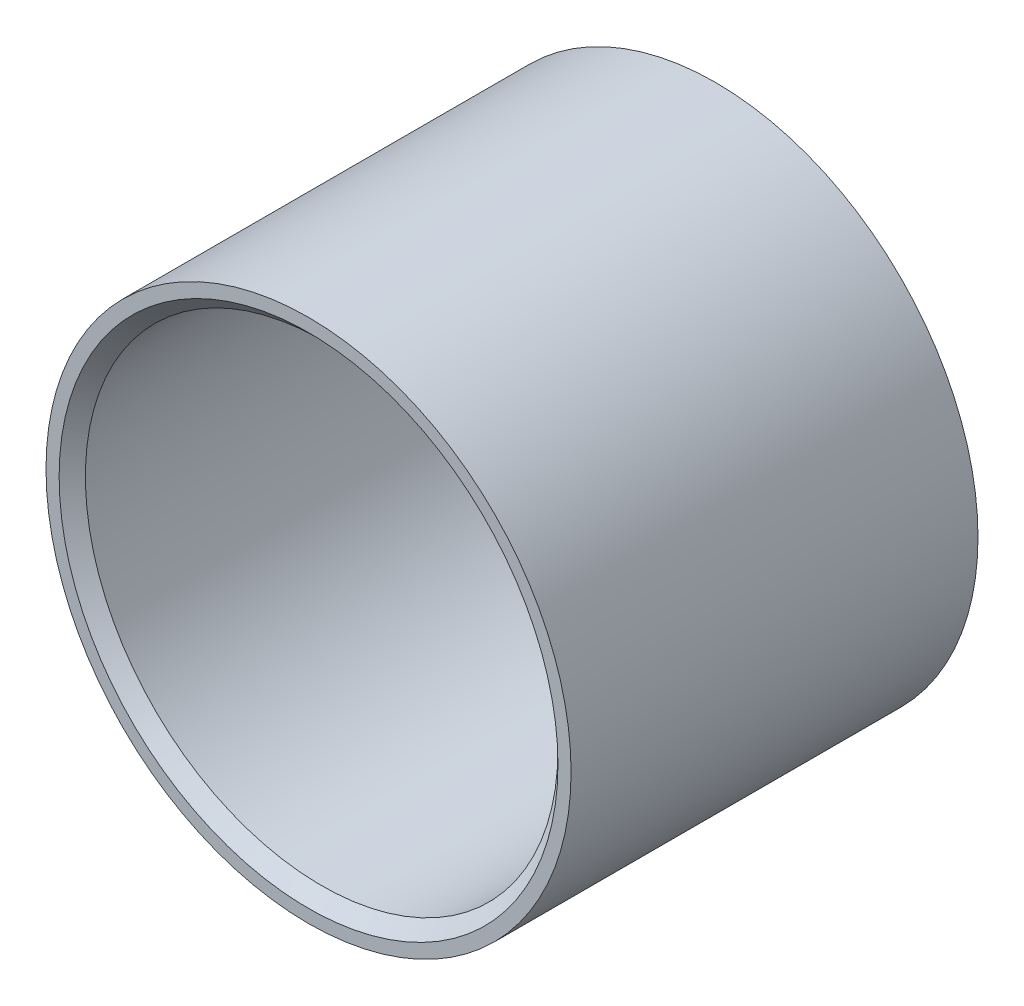
ISO-10303-21;
HEADER;
FILE_DESCRIPTION(('STEP AP214'),'2;1');
FILE_NAME('part.step','',(''),(''),'','','');
FILE_SCHEMA(('AUTOMOTIVE_DESIGN { 1 0 10303 214 1 1 1 1 }'));
ENDSEC;
DATA;
#1=APPLICATION_CONTEXT('core data for automotive mechanical design processes');
#2=APPLICATION_PROTOCOL_DEFINITION('international standard','automotive_design',2000,#1);
#3=PRODUCT_CONTEXT('',#1,'mechanical');
#4=PRODUCT('Part','Part','',(#3));
#5=PRODUCT_RELATED_PRODUCT_CATEGORY('part','',(#4));
#6=PRODUCT_DEFINITION_FORMATION('','',#4);
#7=PRODUCT_DEFINITION_CONTEXT('part definition',#1,'design');
#8=PRODUCT_DEFINITION('design','',#6,#7);
#9=PRODUCT_DEFINITION_SHAPE('','',#8);
#10=(LENGTH_UNIT() NAMED_UNIT(*) SI_UNIT(.MILLI.,.METRE.));
#11=(NAMED_UNIT(*) PLANE_ANGLE_UNIT() SI_UNIT($,.RADIAN.));
#12=(NAMED_UNIT(*) SI_UNIT($,.STERADIAN.) SOLID_ANGLE_UNIT());
#13=UNCERTAINTY_MEASURE_WITH_UNIT(LENGTH_MEASURE(1.E-05),#10,'distance_accuracy_value','');
#14=(GEOMETRIC_REPRESENTATION_CONTEXT(3) GLOBAL_UNCERTAINTY_ASSIGNED_CONTEXT((#13)) GLOBAL_UNIT_ASSIGNED_CONTEXT((#10,
#11,#12)) REPRESENTATION_CONTEXT('',''));
#15=CARTESIAN_POINT('',(0.,0.,0.));
#16=DIRECTION('',(0.,0.,1.));
#17=DIRECTION('',(1.,0.,0.));
#18=AXIS2_PLACEMENT_3D('',#15,#16,#17);
#19=CARTESIAN_POINT('',(0.,0.,15.5));
#20=DIRECTION('',(0.,0.,1.));
#21=DIRECTION('',(1.,0.,0.));
#22=AXIS2_PLACEMENT_3D('',#19,#20,#21);
#23=PLANE('',#22);
#24=CARTESIAN_POINT('',(0.,0.,15.5));
#25=DIRECTION('',(0.,0.,1.));
#26=DIRECTION('',(1.,0.,0.));
#27=AXIS2_PLACEMENT_3D('',#24,#25,#26);
#28=CIRCLE('',#27,9.5);
#29=CARTESIAN_POINT('',(9.5,0.,15.5));
#30=VERTEX_POINT('',#29);
#31=EDGE_CURVE('E10',#30,#30,#28,.F.);
#32=ORIENTED_EDGE('',*,*,#31,.T.);
#33=EDGE_LOOP('',(#32));
#34=FACE_BOUND('',#33,.T.);
#35=CARTESIAN_POINT('',(0.,0.,15.5));
#36=DIRECTION('',(0.,0.,1.));
#37=DIRECTION('',(1.,0.,0.));
#38=AXIS2_PLACEMENT_3D('',#35,#36,#37);
#39=CIRCLE('',#38,10.);
#40=CARTESIAN_POINT('',(10.,0.,15.5));
#41=VERTEX_POINT('',#40);
#42=EDGE_CURVE('E64',#41,#41,#39,.T.);
#43=ORIENTED_EDGE('',*,*,#42,.T.);
#44=EDGE_LOOP('',(#43));
#45=FACE_BOUND('',#44,.T.);
#46=ADVANCED_FACE('F39',(#34,#45),#23,.T.);
#47=CARTESIAN_POINT('',(0.,0.,0.));
#48=DIRECTION('',(0.,0.,1.));
#49=DIRECTION('',(1.,0.,0.));
#50=AXIS2_PLACEMENT_3D('',#47,#48,#49);
#51=PLANE('',#50);
#52=CARTESIAN_POINT('',(0.,0.,0.));
#53=DIRECTION('',(0.,0.,1.));
#54=DIRECTION('',(1.,0.,0.));
#55=AXIS2_PLACEMENT_3D('',#52,#53,#54);
#56=CIRCLE('',#55,9.5);
#57=CARTESIAN_POINT('',(9.5,0.,0.));
#58=VERTEX_POINT('',#57);
#59=EDGE_CURVE('E58',#58,#58,#56,.T.);
#60=ORIENTED_EDGE('',*,*,#59,.T.);
#61=EDGE_LOOP('',(#60));
#62=FACE_BOUND('',#61,.T.);
#63=CARTESIAN_POINT('',(0.,0.,0.));
#64=DIRECTION('',(0.,0.,1.));
#65=DIRECTION('',(1.,0.,0.));
#66=AXIS2_PLACEMENT_3D('',#63,#64,#65);
#67=CIRCLE('',#66,10.);
#68=CARTESIAN_POINT('',(10.,0.,0.));
#69=VERTEX_POINT('',#68);
#70=EDGE_CURVE('E65',#69,#69,#67,.T.);
#71=ORIENTED_EDGE('',*,*,#70,.F.);
#72=EDGE_LOOP('',(#71));
#73=FACE_BOUND('',#72,.T.);
#74=ADVANCED_FACE('F78',(#62,#73),#51,.F.);
#75=CARTESIAN_POINT('',(0.,0.,15.5));
#76=DIRECTION('',(0.,0.,-1.));
#77=DIRECTION('',(-1.,0.,0.));
#78=AXIS2_PLACEMENT_3D('',#75,#76,#77);
#79=CYLINDRICAL_SURFACE('',#78,10.);
#80=ORIENTED_EDGE('',*,*,#42,.F.);
#81=EDGE_LOOP('',(#80));
#82=FACE_BOUND('',#81,.T.);
#83=ORIENTED_EDGE('',*,*,#70,.T.);
#84=EDGE_LOOP('',(#83));
#85=FACE_BOUND('',#84,.T.);
#86=ADVANCED_FACE('F74',(#82,#85),#79,.T.);
#87=CARTESIAN_POINT('',(0.,0.,15.5));
#88=DIRECTION('',(0.,0.,-1.));
#89=DIRECTION('',(-1.,0.,0.));
#90=AXIS2_PLACEMENT_3D('',#87,#88,#89);
#91=CYLINDRICAL_SURFACE('',#90,9.);
#92=CARTESIAN_POINT('',(0.,0.,0.499999999999997));
#93=DIRECTION('',(0.,0.,1.));
#94=DIRECTION('',(1.,0.,0.));
#95=AXIS2_PLACEMENT_3D('',#92,#93,#94);
#96=CIRCLE('',#95,9.);
#97=CARTESIAN_POINT('',(9.,0.,0.499999999999997));
#98=VERTEX_POINT('',#97);
#99=EDGE_CURVE('E48',#98,#98,#96,.F.);
#100=ORIENTED_EDGE('',*,*,#99,.T.);
#101=EDGE_LOOP('',(#100));
#102=FACE_BOUND('',#101,.T.);
#103=CARTESIAN_POINT('',(0.,0.,15.));
#104=DIRECTION('',(0.,0.,1.));
#105=DIRECTION('',(1.,0.,0.));
#106=AXIS2_PLACEMENT_3D('',#103,#104,#105);
#107=CIRCLE('',#106,9.);
#108=CARTESIAN_POINT('',(9.,0.,15.));
#109=VERTEX_POINT('',#108);
#110=EDGE_CURVE('E53',#109,#109,#107,.T.);
#111=ORIENTED_EDGE('',*,*,#110,.T.);
#112=EDGE_LOOP('',(#111));
#113=FACE_BOUND('',#112,.T.);
#114=ADVANCED_FACE('F77',(#102,#113),#91,.F.);
#115=CARTESIAN_POINT('',(0.,0.,0.));
#116=DIRECTION('',(0.,0.,-1.));
#117=DIRECTION('',(-1.,0.,0.));
#118=AXIS2_PLACEMENT_3D('',#115,#116,#117);
#119=CONICAL_SURFACE('',#118,9.5,0.785398163397448);
#120=ORIENTED_EDGE('',*,*,#99,.F.);
#121=EDGE_LOOP('',(#120));
#122=FACE_BOUND('',#121,.T.);
#123=ORIENTED_EDGE('',*,*,#59,.F.);
#124=EDGE_LOOP('',(#123));
#125=FACE_BOUND('',#124,.T.);
#126=ADVANCED_FACE('F91',(#122,#125),#119,.F.);
#127=CARTESIAN_POINT('',(0.,0.,15.));
#128=DIRECTION('',(0.,0.,1.));
#129=DIRECTION('',(1.,0.,0.));
#130=AXIS2_PLACEMENT_3D('',#127,#128,#129);
#131=CONICAL_SURFACE('',#130,9.,0.785398163397448);
#132=ORIENTED_EDGE('',*,*,#31,.F.);
#133=EDGE_LOOP('',(#132));
#134=FACE_BOUND('',#133,.T.);
#135=ORIENTED_EDGE('',*,*,#110,.F.);
#136=EDGE_LOOP('',(#135));
#137=FACE_BOUND('',#136,.T.);
#138=ADVANCED_FACE('F42',(#134,#137),#131,.F.);
#139=CLOSED_SHELL('',(#46,#74,#86,#114,#126,#138));
#140=MANIFOLD_SOLID_BREP('B2',#139);
#141=ADVANCED_BREP_SHAPE_REPRESENTATION('',(#18,#140),#14);
#142=SHAPE_DEFINITION_REPRESENTATION(#9,#141);
ENDSEC;
END-ISO-10303-21;
